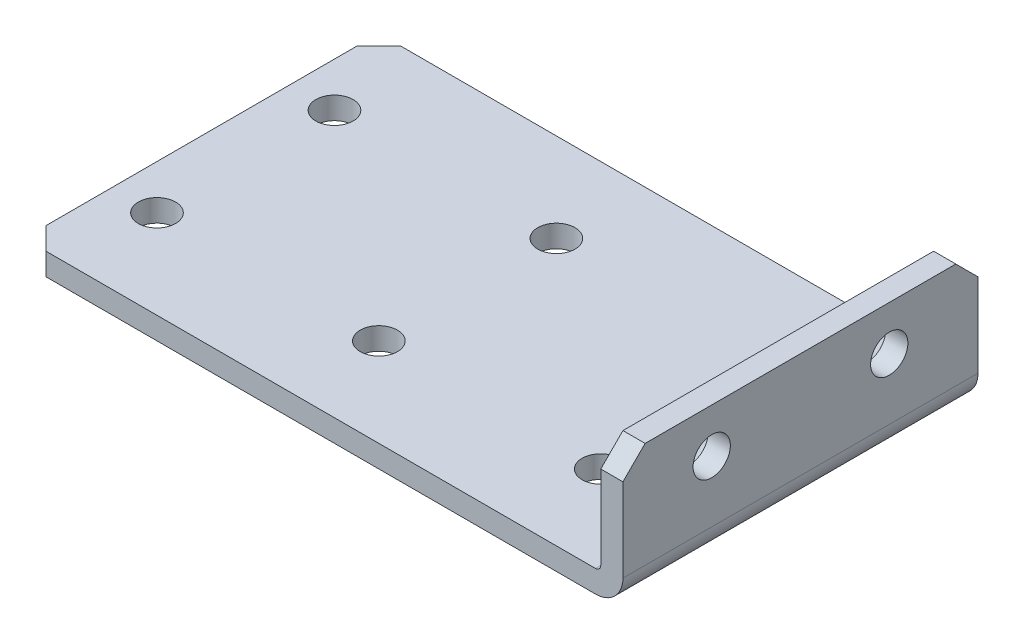
ISO-10303-21;
HEADER;
FILE_DESCRIPTION(('STEP AP214'),'2;1');
FILE_NAME('part.step','',(''),(''),'','','');
FILE_SCHEMA(('AUTOMOTIVE_DESIGN { 1 0 10303 214 1 1 1 1 }'));
ENDSEC;
DATA;
#1=APPLICATION_CONTEXT('core data for automotive mechanical design processes');
#2=APPLICATION_PROTOCOL_DEFINITION('international standard','automotive_design',2000,#1);
#3=PRODUCT_CONTEXT('',#1,'mechanical');
#4=PRODUCT('Part','Part','',(#3));
#5=PRODUCT_RELATED_PRODUCT_CATEGORY('part','',(#4));
#6=PRODUCT_DEFINITION_FORMATION('','',#4);
#7=PRODUCT_DEFINITION_CONTEXT('part definition',#1,'design');
#8=PRODUCT_DEFINITION('design','',#6,#7);
#9=PRODUCT_DEFINITION_SHAPE('','',#8);
#10=(LENGTH_UNIT() NAMED_UNIT(*) SI_UNIT(.MILLI.,.METRE.));
#11=(NAMED_UNIT(*) PLANE_ANGLE_UNIT() SI_UNIT($,.RADIAN.));
#12=(NAMED_UNIT(*) SI_UNIT($,.STERADIAN.) SOLID_ANGLE_UNIT());
#13=UNCERTAINTY_MEASURE_WITH_UNIT(LENGTH_MEASURE(1.E-05),#10,'distance_accuracy_value','');
#14=(GEOMETRIC_REPRESENTATION_CONTEXT(3) GLOBAL_UNCERTAINTY_ASSIGNED_CONTEXT((#13)) GLOBAL_UNIT_ASSIGNED_CONTEXT((#10,
#11,#12)) REPRESENTATION_CONTEXT('',''));
#15=CARTESIAN_POINT('',(0.,0.,0.));
#16=DIRECTION('',(0.,0.,1.));
#17=DIRECTION('',(1.,0.,0.));
#18=AXIS2_PLACEMENT_3D('',#15,#16,#17);
#19=CARTESIAN_POINT('',(0.,3.175,-63.5));
#20=DIRECTION('',(0.,0.,1.));
#21=DIRECTION('',(-1.,0.,0.));
#22=AXIS2_PLACEMENT_3D('',#19,#20,#21);
#23=PLANE('',#22);
#24=DIRECTION('',(1.,0.,0.));
#25=VECTOR('',#24,1.);
#26=CARTESIAN_POINT('',(0.,0.,-63.5));
#27=LINE('',#26,#25);
#28=CARTESIAN_POINT('',(81.788,0.,-63.5));
#29=VERTEX_POINT('',#28);
#30=CARTESIAN_POINT('',(3.17500000000001,0.,-63.5));
#31=VERTEX_POINT('',#30);
#32=EDGE_CURVE('E172',#29,#31,#27,.F.);
#33=ORIENTED_EDGE('',*,*,#32,.T.);
#34=DIRECTION('',(0.,-1.,0.));
#35=VECTOR('',#34,1.);
#36=CARTESIAN_POINT('',(3.17500000000001,3.175,-63.5));
#37=LINE('',#36,#35);
#38=CARTESIAN_POINT('',(3.17500000000001,3.175,-63.5));
#39=VERTEX_POINT('',#38);
#40=EDGE_CURVE('E201',#31,#39,#37,.F.);
#41=ORIENTED_EDGE('',*,*,#40,.T.);
#42=DIRECTION('',(-1.,0.,0.));
#43=VECTOR('',#42,1.);
#44=CARTESIAN_POINT('',(0.,3.175,-63.5));
#45=LINE('',#44,#43);
#46=CARTESIAN_POINT('',(81.788,3.175,-63.5));
#47=VERTEX_POINT('',#46);
#48=EDGE_CURVE('E185',#47,#39,#45,.T.);
#49=ORIENTED_EDGE('',*,*,#48,.F.);
#50=DIRECTION('',(0.,1.,0.));
#51=VECTOR('',#50,1.);
#52=CARTESIAN_POINT('',(81.788,3.175,-63.5));
#53=LINE('',#52,#51);
#54=EDGE_CURVE('E181',#29,#47,#53,.T.);
#55=ORIENTED_EDGE('',*,*,#54,.F.);
#56=EDGE_LOOP('',(#33,#41,#49,#55));
#57=FACE_BOUND('',#56,.T.);
#58=ADVANCED_FACE('F62',(#57),#23,.F.);
#59=CARTESIAN_POINT('',(0.,3.175,0.));
#60=DIRECTION('',(1.,0.,0.));
#61=DIRECTION('',(0.,0.,1.));
#62=AXIS2_PLACEMENT_3D('',#59,#60,#61);
#63=PLANE('',#62);
#64=DIRECTION('',(0.,0.,1.));
#65=VECTOR('',#64,1.);
#66=CARTESIAN_POINT('',(0.,3.175,0.));
#67=LINE('',#66,#65);
#68=CARTESIAN_POINT('',(0.,3.175,-60.325));
#69=VERTEX_POINT('',#68);
#70=CARTESIAN_POINT('',(0.,3.175,-15.875));
#71=VERTEX_POINT('',#70);
#72=EDGE_CURVE('E176',#69,#71,#67,.T.);
#73=ORIENTED_EDGE('',*,*,#72,.F.);
#74=DIRECTION('',(0.,1.,0.));
#75=VECTOR('',#74,1.);
#76=CARTESIAN_POINT('',(0.,3.175,-60.325));
#77=LINE('',#76,#75);
#78=CARTESIAN_POINT('',(0.,0.,-60.325));
#79=VERTEX_POINT('',#78);
#80=EDGE_CURVE('E210',#69,#79,#77,.F.);
#81=ORIENTED_EDGE('',*,*,#80,.T.);
#82=DIRECTION('',(0.,0.,-1.));
#83=VECTOR('',#82,1.);
#84=CARTESIAN_POINT('',(0.,0.,-63.5));
#85=LINE('',#84,#83);
#86=CARTESIAN_POINT('',(0.,0.,-15.875));
#87=VERTEX_POINT('',#86);
#88=EDGE_CURVE('E174',#79,#87,#85,.F.);
#89=ORIENTED_EDGE('',*,*,#88,.T.);
#90=DIRECTION('',(0.,-1.,0.));
#91=VECTOR('',#90,1.);
#92=CARTESIAN_POINT('',(0.,3.175,-15.875));
#93=LINE('',#92,#91);
#94=EDGE_CURVE('E208',#87,#71,#93,.F.);
#95=ORIENTED_EDGE('',*,*,#94,.T.);
#96=EDGE_LOOP('',(#73,#81,#89,#95));
#97=FACE_BOUND('',#96,.T.);
#98=ADVANCED_FACE('F229',(#97),#63,.F.);
#99=CARTESIAN_POINT('',(0.,3.175,-63.5));
#100=DIRECTION('',(0.,-1.,0.));
#101=DIRECTION('',(0.,0.,-1.));
#102=AXIS2_PLACEMENT_3D('',#99,#100,#101);
#103=PLANE('',#102);
#104=CARTESIAN_POINT('',(38.1,3.175,-25.4));
#105=DIRECTION('',(0.,1.,0.));
#106=DIRECTION('',(0.,0.,1.));
#107=AXIS2_PLACEMENT_3D('',#104,#105,#106);
#108=CIRCLE('',#107,2.667);
#109=CARTESIAN_POINT('',(38.1,3.175,-22.733));
#110=VERTEX_POINT('',#109);
#111=EDGE_CURVE('E288',#110,#110,#108,.T.);
#112=ORIENTED_EDGE('',*,*,#111,.F.);
#113=EDGE_LOOP('',(#112));
#114=FACE_BOUND('',#113,.T.);
#115=CARTESIAN_POINT('',(38.1,3.175,-50.8));
#116=DIRECTION('',(0.,1.,0.));
#117=DIRECTION('',(0.,0.,1.));
#118=AXIS2_PLACEMENT_3D('',#115,#116,#117);
#119=CIRCLE('',#118,2.667);
#120=CARTESIAN_POINT('',(38.1,3.175,-48.133));
#121=VERTEX_POINT('',#120);
#122=EDGE_CURVE('E282',#121,#121,#119,.T.);
#123=ORIENTED_EDGE('',*,*,#122,.F.);
#124=EDGE_LOOP('',(#123));
#125=FACE_BOUND('',#124,.T.);
#126=CARTESIAN_POINT('',(69.85,3.175,-25.4));
#127=DIRECTION('',(0.,1.,0.));
#128=DIRECTION('',(0.,0.,1.));
#129=AXIS2_PLACEMENT_3D('',#126,#127,#128);
#130=CIRCLE('',#129,2.667);
#131=CARTESIAN_POINT('',(69.85,3.175,-22.733));
#132=VERTEX_POINT('',#131);
#133=EDGE_CURVE('E276',#132,#132,#130,.T.);
#134=ORIENTED_EDGE('',*,*,#133,.F.);
#135=EDGE_LOOP('',(#134));
#136=FACE_BOUND('',#135,.T.);
#137=CARTESIAN_POINT('',(69.85,3.175,-50.8));
#138=DIRECTION('',(0.,1.,0.));
#139=DIRECTION('',(0.,0.,1.));
#140=AXIS2_PLACEMENT_3D('',#137,#138,#139);
#141=CIRCLE('',#140,2.667);
#142=CARTESIAN_POINT('',(69.85,3.175,-48.133));
#143=VERTEX_POINT('',#142);
#144=EDGE_CURVE('E270',#143,#143,#141,.T.);
#145=ORIENTED_EDGE('',*,*,#144,.F.);
#146=EDGE_LOOP('',(#145));
#147=FACE_BOUND('',#146,.T.);
#148=CARTESIAN_POINT('',(6.35,3.175,-25.4));
#149=DIRECTION('',(0.,1.,0.));
#150=DIRECTION('',(0.,0.,1.));
#151=AXIS2_PLACEMENT_3D('',#148,#149,#150);
#152=CIRCLE('',#151,2.667);
#153=CARTESIAN_POINT('',(6.35,3.175,-22.733));
#154=VERTEX_POINT('',#153);
#155=EDGE_CURVE('E264',#154,#154,#152,.T.);
#156=ORIENTED_EDGE('',*,*,#155,.F.);
#157=EDGE_LOOP('',(#156));
#158=FACE_BOUND('',#157,.T.);
#159=CARTESIAN_POINT('',(6.34999999999999,3.175,-50.8));
#160=DIRECTION('',(0.,1.,0.));
#161=DIRECTION('',(0.,0.,1.));
#162=AXIS2_PLACEMENT_3D('',#159,#160,#161);
#163=CIRCLE('',#162,2.667);
#164=CARTESIAN_POINT('',(6.34999999999999,3.175,-48.133));
#165=VERTEX_POINT('',#164);
#166=EDGE_CURVE('E258',#165,#165,#163,.T.);
#167=ORIENTED_EDGE('',*,*,#166,.F.);
#168=EDGE_LOOP('',(#167));
#169=FACE_BOUND('',#168,.T.);
#170=ORIENTED_EDGE('',*,*,#48,.T.);
#171=DIRECTION('',(0.707106781186548,0.,-0.707106781186548));
#172=VECTOR('',#171,1.);
#173=CARTESIAN_POINT('',(3.17500000000001,3.175,-63.5));
#174=LINE('',#173,#172);
#175=EDGE_CURVE('E206',#39,#69,#174,.F.);
#176=ORIENTED_EDGE('',*,*,#175,.T.);
#177=ORIENTED_EDGE('',*,*,#72,.T.);
#178=DIRECTION('',(-0.707106781186548,0.,-0.707106781186547));
#179=VECTOR('',#178,1.);
#180=CARTESIAN_POINT('',(3.17500000000001,3.175,-12.7));
#181=LINE('',#180,#179);
#182=CARTESIAN_POINT('',(3.17500000000001,3.175,-12.7));
#183=VERTEX_POINT('',#182);
#184=EDGE_CURVE('E204',#71,#183,#181,.F.);
#185=ORIENTED_EDGE('',*,*,#184,.T.);
#186=DIRECTION('',(1.,0.,0.));
#187=VECTOR('',#186,1.);
#188=CARTESIAN_POINT('',(0.,3.175,-12.7));
#189=LINE('',#188,#187);
#190=CARTESIAN_POINT('',(81.788,3.175,-12.7));
#191=VERTEX_POINT('',#190);
#192=EDGE_CURVE('E305',#183,#191,#189,.T.);
#193=ORIENTED_EDGE('',*,*,#192,.T.);
#194=DIRECTION('',(0.,0.,-1.));
#195=VECTOR('',#194,1.);
#196=CARTESIAN_POINT('',(81.788,3.175,0.));
#197=LINE('',#196,#195);
#198=EDGE_CURVE('E230',#191,#47,#197,.T.);
#199=ORIENTED_EDGE('',*,*,#198,.T.);
#200=EDGE_LOOP('',(#170,#176,#177,#185,#193,#199));
#201=FACE_BOUND('',#200,.T.);
#202=ADVANCED_FACE('F226',(#114,#125,#136,#147,#158,#169,#201),#103,.F.);
#203=CARTESIAN_POINT('',(0.,0.,-63.5));
#204=DIRECTION('',(0.,-1.,0.));
#205=DIRECTION('',(0.,0.,-1.));
#206=AXIS2_PLACEMENT_3D('',#203,#204,#205);
#207=PLANE('',#206);
#208=ORIENTED_EDGE('',*,*,#88,.F.);
#209=DIRECTION('',(-0.707106781186548,0.,0.707106781186548));
#210=VECTOR('',#209,1.);
#211=CARTESIAN_POINT('',(1.58750000000001,0.,-61.9125));
#212=LINE('',#211,#210);
#213=EDGE_CURVE('E213',#79,#31,#212,.F.);
#214=ORIENTED_EDGE('',*,*,#213,.T.);
#215=ORIENTED_EDGE('',*,*,#32,.F.);
#216=DIRECTION('',(0.,0.,-1.));
#217=VECTOR('',#216,1.);
#218=CARTESIAN_POINT('',(81.788,0.,-63.5));
#219=LINE('',#218,#217);
#220=CARTESIAN_POINT('',(81.788,0.,-12.7));
#221=VERTEX_POINT('',#220);
#222=EDGE_CURVE('E162',#221,#29,#219,.T.);
#223=ORIENTED_EDGE('',*,*,#222,.F.);
#224=DIRECTION('',(-1.,0.,0.));
#225=VECTOR('',#224,1.);
#226=CARTESIAN_POINT('',(-9.42940188980387,0.,-12.7));
#227=LINE('',#226,#225);
#228=CARTESIAN_POINT('',(3.17500000000001,0.,-12.7));
#229=VERTEX_POINT('',#228);
#230=EDGE_CURVE('E150',#221,#229,#227,.T.);
#231=ORIENTED_EDGE('',*,*,#230,.T.);
#232=DIRECTION('',(0.707106781186548,0.,0.707106781186547));
#233=VECTOR('',#232,1.);
#234=CARTESIAN_POINT('',(-23.8125,0.,-39.6875));
#235=LINE('',#234,#233);
#236=EDGE_CURVE('E77',#229,#87,#235,.F.);
#237=ORIENTED_EDGE('',*,*,#236,.T.);
#238=EDGE_LOOP('',(#208,#214,#215,#223,#231,#237));
#239=FACE_BOUND('',#238,.T.);
#240=CARTESIAN_POINT('',(38.1,0.,-25.4));
#241=DIRECTION('',(0.,1.,0.));
#242=DIRECTION('',(0.,0.,1.));
#243=AXIS2_PLACEMENT_3D('',#240,#241,#242);
#244=CIRCLE('',#243,2.667);
#245=CARTESIAN_POINT('',(38.1,0.,-22.733));
#246=VERTEX_POINT('',#245);
#247=EDGE_CURVE('E285',#246,#246,#244,.T.);
#248=ORIENTED_EDGE('',*,*,#247,.T.);
#249=EDGE_LOOP('',(#248));
#250=FACE_BOUND('',#249,.T.);
#251=CARTESIAN_POINT('',(38.1,0.,-50.8));
#252=DIRECTION('',(0.,1.,0.));
#253=DIRECTION('',(0.,0.,1.));
#254=AXIS2_PLACEMENT_3D('',#251,#252,#253);
#255=CIRCLE('',#254,2.667);
#256=CARTESIAN_POINT('',(38.1,0.,-48.133));
#257=VERTEX_POINT('',#256);
#258=EDGE_CURVE('E279',#257,#257,#255,.T.);
#259=ORIENTED_EDGE('',*,*,#258,.T.);
#260=EDGE_LOOP('',(#259));
#261=FACE_BOUND('',#260,.T.);
#262=CARTESIAN_POINT('',(69.85,0.,-25.4));
#263=DIRECTION('',(0.,1.,0.));
#264=DIRECTION('',(0.,0.,1.));
#265=AXIS2_PLACEMENT_3D('',#262,#263,#264);
#266=CIRCLE('',#265,2.667);
#267=CARTESIAN_POINT('',(69.85,0.,-22.733));
#268=VERTEX_POINT('',#267);
#269=EDGE_CURVE('E273',#268,#268,#266,.T.);
#270=ORIENTED_EDGE('',*,*,#269,.T.);
#271=EDGE_LOOP('',(#270));
#272=FACE_BOUND('',#271,.T.);
#273=CARTESIAN_POINT('',(69.85,0.,-50.8));
#274=DIRECTION('',(0.,1.,0.));
#275=DIRECTION('',(0.,0.,1.));
#276=AXIS2_PLACEMENT_3D('',#273,#274,#275);
#277=CIRCLE('',#276,2.667);
#278=CARTESIAN_POINT('',(69.85,0.,-48.133));
#279=VERTEX_POINT('',#278);
#280=EDGE_CURVE('E267',#279,#279,#277,.T.);
#281=ORIENTED_EDGE('',*,*,#280,.T.);
#282=EDGE_LOOP('',(#281));
#283=FACE_BOUND('',#282,.T.);
#284=CARTESIAN_POINT('',(6.35,0.,-25.4));
#285=DIRECTION('',(0.,1.,0.));
#286=DIRECTION('',(0.,0.,1.));
#287=AXIS2_PLACEMENT_3D('',#284,#285,#286);
#288=CIRCLE('',#287,2.667);
#289=CARTESIAN_POINT('',(6.35,0.,-22.733));
#290=VERTEX_POINT('',#289);
#291=EDGE_CURVE('E261',#290,#290,#288,.T.);
#292=ORIENTED_EDGE('',*,*,#291,.T.);
#293=EDGE_LOOP('',(#292));
#294=FACE_BOUND('',#293,.T.);
#295=CARTESIAN_POINT('',(6.34999999999999,0.,-50.8));
#296=DIRECTION('',(0.,1.,0.));
#297=DIRECTION('',(0.,0.,1.));
#298=AXIS2_PLACEMENT_3D('',#295,#296,#297);
#299=CIRCLE('',#298,2.667);
#300=CARTESIAN_POINT('',(6.34999999999999,0.,-48.133));
#301=VERTEX_POINT('',#300);
#302=EDGE_CURVE('E243',#301,#301,#299,.T.);
#303=ORIENTED_EDGE('',*,*,#302,.T.);
#304=EDGE_LOOP('',(#303));
#305=FACE_BOUND('',#304,.T.);
#306=ADVANCED_FACE('F169',(#239,#250,#261,#272,#283,#294,#305),#207,.T.);
#307=CARTESIAN_POINT('',(81.788,3.937,-63.5));
#308=DIRECTION('',(0.,0.,1.));
#309=DIRECTION('',(1.,0.,0.));
#310=AXIS2_PLACEMENT_3D('',#307,#308,#309);
#311=PLANE('',#310);
#312=CARTESIAN_POINT('',(81.788,3.937,-63.5));
#313=DIRECTION('',(0.,0.,-1.));
#314=DIRECTION('',(-1.,0.,0.));
#315=AXIS2_PLACEMENT_3D('',#312,#313,#314);
#316=CIRCLE('',#315,0.761999999999999);
#317=CARTESIAN_POINT('',(82.55,3.937,-63.5));
#318=VERTEX_POINT('',#317);
#319=EDGE_CURVE('E234',#318,#47,#316,.T.);
#320=ORIENTED_EDGE('',*,*,#319,.F.);
#321=DIRECTION('',(-1.,0.,0.));
#322=VECTOR('',#321,1.);
#323=CARTESIAN_POINT('',(82.55,3.937,-63.5));
#324=LINE('',#323,#322);
#325=CARTESIAN_POINT('',(85.725,3.93699999999999,-63.5));
#326=VERTEX_POINT('',#325);
#327=EDGE_CURVE('E242',#318,#326,#324,.F.);
#328=ORIENTED_EDGE('',*,*,#327,.T.);
#329=CARTESIAN_POINT('',(81.788,3.937,-63.5));
#330=DIRECTION('',(0.,0.,-1.));
#331=DIRECTION('',(-1.,0.,0.));
#332=AXIS2_PLACEMENT_3D('',#329,#330,#331);
#333=CIRCLE('',#332,3.937);
#334=EDGE_CURVE('E178',#326,#29,#333,.T.);
#335=ORIENTED_EDGE('',*,*,#334,.T.);
#336=ORIENTED_EDGE('',*,*,#54,.T.);
#337=EDGE_LOOP('',(#320,#328,#335,#336));
#338=FACE_BOUND('',#337,.T.);
#339=ADVANCED_FACE('F406',(#338),#311,.F.);
#340=CARTESIAN_POINT('',(81.788,3.937,-63.5));
#341=DIRECTION('',(0.,0.,-1.));
#342=DIRECTION('',(1.,0.,0.));
#343=AXIS2_PLACEMENT_3D('',#340,#341,#342);
#344=CYLINDRICAL_SURFACE('',#343,3.937);
#345=CARTESIAN_POINT('',(81.788,3.937,-12.7));
#346=DIRECTION('',(0.,0.,-1.));
#347=DIRECTION('',(-1.,0.,0.));
#348=AXIS2_PLACEMENT_3D('',#345,#346,#347);
#349=CIRCLE('',#348,3.937);
#350=CARTESIAN_POINT('',(85.725,3.93699999999999,-12.7));
#351=VERTEX_POINT('',#350);
#352=EDGE_CURVE('E154',#221,#351,#349,.F.);
#353=ORIENTED_EDGE('',*,*,#352,.F.);
#354=ORIENTED_EDGE('',*,*,#222,.T.);
#355=ORIENTED_EDGE('',*,*,#334,.F.);
#356=DIRECTION('',(0.,0.,-1.));
#357=VECTOR('',#356,1.);
#358=CARTESIAN_POINT('',(85.725,3.93699999999998,0.));
#359=LINE('',#358,#357);
#360=EDGE_CURVE('E165',#326,#351,#359,.F.);
#361=ORIENTED_EDGE('',*,*,#360,.T.);
#362=EDGE_LOOP('',(#353,#354,#355,#361));
#363=FACE_BOUND('',#362,.T.);
#364=ADVANCED_FACE('F161',(#363),#344,.T.);
#365=CARTESIAN_POINT('',(81.788,3.937,-63.5));
#366=DIRECTION('',(0.,0.,-1.));
#367=DIRECTION('',(1.,0.,0.));
#368=AXIS2_PLACEMENT_3D('',#365,#366,#367);
#369=CYLINDRICAL_SURFACE('',#368,0.761999999999999);
#370=ORIENTED_EDGE('',*,*,#198,.F.);
#371=CARTESIAN_POINT('',(81.788,3.937,-12.7));
#372=DIRECTION('',(0.,0.,-1.));
#373=DIRECTION('',(-1.,0.,0.));
#374=AXIS2_PLACEMENT_3D('',#371,#372,#373);
#375=CIRCLE('',#374,0.761999999999999);
#376=CARTESIAN_POINT('',(82.55,3.937,-12.7));
#377=VERTEX_POINT('',#376);
#378=EDGE_CURVE('E307',#191,#377,#375,.F.);
#379=ORIENTED_EDGE('',*,*,#378,.T.);
#380=DIRECTION('',(0.,0.,-1.));
#381=VECTOR('',#380,1.);
#382=CARTESIAN_POINT('',(82.55,3.937,0.));
#383=LINE('',#382,#381);
#384=EDGE_CURVE('E240',#377,#318,#383,.T.);
#385=ORIENTED_EDGE('',*,*,#384,.T.);
#386=ORIENTED_EDGE('',*,*,#319,.T.);
#387=EDGE_LOOP('',(#370,#379,#385,#386));
#388=FACE_BOUND('',#387,.T.);
#389=ADVANCED_FACE('F318',(#388),#369,.F.);
#390=CARTESIAN_POINT('',(85.7250000000001,19.05,-63.5));
#391=DIRECTION('',(0.,0.,1.));
#392=DIRECTION('',(1.,0.,0.));
#393=AXIS2_PLACEMENT_3D('',#390,#391,#392);
#394=PLANE('',#393);
#395=DIRECTION('',(0.,-1.,0.));
#396=VECTOR('',#395,1.);
#397=CARTESIAN_POINT('',(82.5500000000001,19.05,-63.5));
#398=LINE('',#397,#396);
#399=CARTESIAN_POINT('',(82.55,15.875,-63.5));
#400=VERTEX_POINT('',#399);
#401=EDGE_CURVE('E247',#318,#400,#398,.F.);
#402=ORIENTED_EDGE('',*,*,#401,.T.);
#403=DIRECTION('',(1.,0.,0.));
#404=VECTOR('',#403,1.);
#405=CARTESIAN_POINT('',(85.725,15.875,-63.5));
#406=LINE('',#405,#404);
#407=CARTESIAN_POINT('',(85.725,15.875,-63.5));
#408=VERTEX_POINT('',#407);
#409=EDGE_CURVE('E195',#400,#408,#406,.T.);
#410=ORIENTED_EDGE('',*,*,#409,.T.);
#411=DIRECTION('',(0.,1.,0.));
#412=VECTOR('',#411,1.);
#413=CARTESIAN_POINT('',(85.7250000000001,19.05,-63.5));
#414=LINE('',#413,#412);
#415=EDGE_CURVE('E253',#326,#408,#414,.T.);
#416=ORIENTED_EDGE('',*,*,#415,.F.);
#417=ORIENTED_EDGE('',*,*,#327,.F.);
#418=EDGE_LOOP('',(#402,#410,#416,#417));
#419=FACE_BOUND('',#418,.T.);
#420=ADVANCED_FACE('F327',(#419),#394,.F.);
#421=CARTESIAN_POINT('',(85.7250000000001,19.05,0.));
#422=DIRECTION('',(-1.,0.,0.));
#423=DIRECTION('',(0.,-1.,0.));
#424=AXIS2_PLACEMENT_3D('',#421,#422,#423);
#425=PLANE('',#424);
#426=CARTESIAN_POINT('',(85.7250000000001,12.7000000000001,-25.4));
#427=DIRECTION('',(-1.,0.,0.));
#428=DIRECTION('',(0.,-1.,0.));
#429=AXIS2_PLACEMENT_3D('',#426,#427,#428);
#430=CIRCLE('',#429,2.667);
#431=CARTESIAN_POINT('',(85.7250000000001,10.0330000000001,-25.4));
#432=VERTEX_POINT('',#431);
#433=EDGE_CURVE('E297',#432,#432,#430,.T.);
#434=ORIENTED_EDGE('',*,*,#433,.T.);
#435=EDGE_LOOP('',(#434));
#436=FACE_BOUND('',#435,.T.);
#437=CARTESIAN_POINT('',(85.7250000000001,12.7000000000001,-50.8));
#438=DIRECTION('',(-1.,0.,0.));
#439=DIRECTION('',(0.,-1.,0.));
#440=AXIS2_PLACEMENT_3D('',#437,#438,#439);
#441=CIRCLE('',#440,2.667);
#442=CARTESIAN_POINT('',(85.7250000000001,10.0330000000001,-50.8));
#443=VERTEX_POINT('',#442);
#444=EDGE_CURVE('E291',#443,#443,#441,.T.);
#445=ORIENTED_EDGE('',*,*,#444,.T.);
#446=EDGE_LOOP('',(#445));
#447=FACE_BOUND('',#446,.T.);
#448=ORIENTED_EDGE('',*,*,#415,.T.);
#449=DIRECTION('',(0.,-0.707106781186548,-0.707106781186548));
#450=VECTOR('',#449,1.);
#451=CARTESIAN_POINT('',(85.7250000000001,19.05,-60.325));
#452=LINE('',#451,#450);
#453=CARTESIAN_POINT('',(85.7250000000001,19.05,-60.325));
#454=VERTEX_POINT('',#453);
#455=EDGE_CURVE('E199',#408,#454,#452,.F.);
#456=ORIENTED_EDGE('',*,*,#455,.T.);
#457=DIRECTION('',(0.,0.,1.));
#458=VECTOR('',#457,1.);
#459=CARTESIAN_POINT('',(85.7250000000001,19.05,0.));
#460=LINE('',#459,#458);
#461=CARTESIAN_POINT('',(85.7250000000001,19.05,-15.875));
#462=VERTEX_POINT('',#461);
#463=EDGE_CURVE('E238',#454,#462,#460,.T.);
#464=ORIENTED_EDGE('',*,*,#463,.T.);
#465=DIRECTION('',(0.,0.707106781186549,-0.707106781186546));
#466=VECTOR('',#465,1.);
#467=CARTESIAN_POINT('',(85.7250000000001,19.05,-15.875));
#468=LINE('',#467,#466);
#469=CARTESIAN_POINT('',(85.725,15.875,-12.7));
#470=VERTEX_POINT('',#469);
#471=EDGE_CURVE('E197',#462,#470,#468,.F.);
#472=ORIENTED_EDGE('',*,*,#471,.T.);
#473=DIRECTION('',(0.,-1.,0.));
#474=VECTOR('',#473,1.);
#475=CARTESIAN_POINT('',(85.7250000000001,19.05,-12.7));
#476=LINE('',#475,#474);
#477=EDGE_CURVE('E167',#470,#351,#476,.T.);
#478=ORIENTED_EDGE('',*,*,#477,.T.);
#479=ORIENTED_EDGE('',*,*,#360,.F.);
#480=EDGE_LOOP('',(#448,#456,#464,#472,#478,#479));
#481=FACE_BOUND('',#480,.T.);
#482=ADVANCED_FACE('F335',(#436,#447,#481),#425,.F.);
#483=CARTESIAN_POINT('',(82.5500000000001,19.05,0.));
#484=DIRECTION('',(-1.,0.,0.));
#485=DIRECTION('',(0.,-1.,0.));
#486=AXIS2_PLACEMENT_3D('',#483,#484,#485);
#487=PLANE('',#486);
#488=DIRECTION('',(0.,0.,-1.));
#489=VECTOR('',#488,1.);
#490=CARTESIAN_POINT('',(82.5500000000001,19.05,0.));
#491=LINE('',#490,#489);
#492=CARTESIAN_POINT('',(82.5500000000001,19.05,-60.325));
#493=VERTEX_POINT('',#492);
#494=CARTESIAN_POINT('',(82.5500000000001,19.05,-15.875));
#495=VERTEX_POINT('',#494);
#496=EDGE_CURVE('E250',#493,#495,#491,.F.);
#497=ORIENTED_EDGE('',*,*,#496,.F.);
#498=DIRECTION('',(0.,0.707106781186548,0.707106781186548));
#499=VECTOR('',#498,1.);
#500=CARTESIAN_POINT('',(82.5500000000002,49.2125,-30.1625));
#501=LINE('',#500,#499);
#502=EDGE_CURVE('E193',#493,#400,#501,.F.);
#503=ORIENTED_EDGE('',*,*,#502,.T.);
#504=ORIENTED_EDGE('',*,*,#401,.F.);
#505=ORIENTED_EDGE('',*,*,#384,.F.);
#506=DIRECTION('',(0.,-1.,0.));
#507=VECTOR('',#506,1.);
#508=CARTESIAN_POINT('',(82.5500000000001,19.05,-12.7));
#509=LINE('',#508,#507);
#510=CARTESIAN_POINT('',(82.55,15.875,-12.7));
#511=VERTEX_POINT('',#510);
#512=EDGE_CURVE('E158',#511,#377,#509,.T.);
#513=ORIENTED_EDGE('',*,*,#512,.F.);
#514=DIRECTION('',(0.,-0.707106781186549,0.707106781186546));
#515=VECTOR('',#514,1.);
#516=CARTESIAN_POINT('',(82.55,11.1125,-7.93750000000004));
#517=LINE('',#516,#515);
#518=EDGE_CURVE('E191',#511,#495,#517,.F.);
#519=ORIENTED_EDGE('',*,*,#518,.T.);
#520=EDGE_LOOP('',(#497,#503,#504,#505,#513,#519));
#521=FACE_BOUND('',#520,.T.);
#522=CARTESIAN_POINT('',(82.55,12.7000000000001,-25.4));
#523=DIRECTION('',(-1.,0.,0.));
#524=DIRECTION('',(0.,-1.,0.));
#525=AXIS2_PLACEMENT_3D('',#522,#523,#524);
#526=CIRCLE('',#525,2.667);
#527=CARTESIAN_POINT('',(82.55,10.0330000000001,-25.4));
#528=VERTEX_POINT('',#527);
#529=EDGE_CURVE('E166',#528,#528,#526,.T.);
#530=ORIENTED_EDGE('',*,*,#529,.F.);
#531=EDGE_LOOP('',(#530));
#532=FACE_BOUND('',#531,.T.);
#533=CARTESIAN_POINT('',(82.55,12.7000000000001,-50.8));
#534=DIRECTION('',(-1.,0.,0.));
#535=DIRECTION('',(0.,-1.,0.));
#536=AXIS2_PLACEMENT_3D('',#533,#534,#535);
#537=CIRCLE('',#536,2.667);
#538=CARTESIAN_POINT('',(82.55,10.0330000000001,-50.8));
#539=VERTEX_POINT('',#538);
#540=EDGE_CURVE('E294',#539,#539,#537,.T.);
#541=ORIENTED_EDGE('',*,*,#540,.F.);
#542=EDGE_LOOP('',(#541));
#543=FACE_BOUND('',#542,.T.);
#544=ADVANCED_FACE('F322',(#521,#532,#543),#487,.T.);
#545=CARTESIAN_POINT('',(85.7250000000001,19.05,0.));
#546=DIRECTION('',(0.,-1.,0.));
#547=DIRECTION('',(1.,0.,0.));
#548=AXIS2_PLACEMENT_3D('',#545,#546,#547);
#549=PLANE('',#548);
#550=ORIENTED_EDGE('',*,*,#463,.F.);
#551=DIRECTION('',(-1.,0.,0.));
#552=VECTOR('',#551,1.);
#553=CARTESIAN_POINT('',(85.7250000000001,19.05,-60.325));
#554=LINE('',#553,#552);
#555=EDGE_CURVE('E188',#454,#493,#554,.T.);
#556=ORIENTED_EDGE('',*,*,#555,.T.);
#557=ORIENTED_EDGE('',*,*,#496,.T.);
#558=DIRECTION('',(1.,0.,0.));
#559=VECTOR('',#558,1.);
#560=CARTESIAN_POINT('',(85.7250000000001,19.05,-15.875));
#561=LINE('',#560,#559);
#562=EDGE_CURVE('E184',#495,#462,#561,.T.);
#563=ORIENTED_EDGE('',*,*,#562,.T.);
#564=EDGE_LOOP('',(#550,#556,#557,#563));
#565=FACE_BOUND('',#564,.T.);
#566=ADVANCED_FACE('F337',(#565),#549,.F.);
#567=CARTESIAN_POINT('',(6.34999999999999,0.,-50.8));
#568=DIRECTION('',(0.,1.,0.));
#569=DIRECTION('',(0.,0.,1.));
#570=AXIS2_PLACEMENT_3D('',#567,#568,#569);
#571=CYLINDRICAL_SURFACE('',#570,2.667);
#572=ORIENTED_EDGE('',*,*,#302,.F.);
#573=EDGE_LOOP('',(#572));
#574=FACE_BOUND('',#573,.T.);
#575=ORIENTED_EDGE('',*,*,#166,.T.);
#576=EDGE_LOOP('',(#575));
#577=FACE_BOUND('',#576,.T.);
#578=ADVANCED_FACE('F390',(#574,#577),#571,.F.);
#579=CARTESIAN_POINT('',(6.35,0.,-25.4));
#580=DIRECTION('',(0.,1.,0.));
#581=DIRECTION('',(0.,0.,1.));
#582=AXIS2_PLACEMENT_3D('',#579,#580,#581);
#583=CYLINDRICAL_SURFACE('',#582,2.667);
#584=ORIENTED_EDGE('',*,*,#291,.F.);
#585=EDGE_LOOP('',(#584));
#586=FACE_BOUND('',#585,.T.);
#587=ORIENTED_EDGE('',*,*,#155,.T.);
#588=EDGE_LOOP('',(#587));
#589=FACE_BOUND('',#588,.T.);
#590=ADVANCED_FACE('F386',(#586,#589),#583,.F.);
#591=CARTESIAN_POINT('',(69.85,0.,-50.8));
#592=DIRECTION('',(0.,1.,0.));
#593=DIRECTION('',(0.,0.,1.));
#594=AXIS2_PLACEMENT_3D('',#591,#592,#593);
#595=CYLINDRICAL_SURFACE('',#594,2.667);
#596=ORIENTED_EDGE('',*,*,#280,.F.);
#597=EDGE_LOOP('',(#596));
#598=FACE_BOUND('',#597,.T.);
#599=ORIENTED_EDGE('',*,*,#144,.T.);
#600=EDGE_LOOP('',(#599));
#601=FACE_BOUND('',#600,.T.);
#602=ADVANCED_FACE('F382',(#598,#601),#595,.F.);
#603=CARTESIAN_POINT('',(69.85,0.,-25.4));
#604=DIRECTION('',(0.,1.,0.));
#605=DIRECTION('',(0.,0.,1.));
#606=AXIS2_PLACEMENT_3D('',#603,#604,#605);
#607=CYLINDRICAL_SURFACE('',#606,2.667);
#608=ORIENTED_EDGE('',*,*,#269,.F.);
#609=EDGE_LOOP('',(#608));
#610=FACE_BOUND('',#609,.T.);
#611=ORIENTED_EDGE('',*,*,#133,.T.);
#612=EDGE_LOOP('',(#611));
#613=FACE_BOUND('',#612,.T.);
#614=ADVANCED_FACE('F378',(#610,#613),#607,.F.);
#615=CARTESIAN_POINT('',(38.1,0.,-50.8));
#616=DIRECTION('',(0.,1.,0.));
#617=DIRECTION('',(0.,0.,1.));
#618=AXIS2_PLACEMENT_3D('',#615,#616,#617);
#619=CYLINDRICAL_SURFACE('',#618,2.667);
#620=ORIENTED_EDGE('',*,*,#258,.F.);
#621=EDGE_LOOP('',(#620));
#622=FACE_BOUND('',#621,.T.);
#623=ORIENTED_EDGE('',*,*,#122,.T.);
#624=EDGE_LOOP('',(#623));
#625=FACE_BOUND('',#624,.T.);
#626=ADVANCED_FACE('F374',(#622,#625),#619,.F.);
#627=CARTESIAN_POINT('',(38.1,0.,-25.4));
#628=DIRECTION('',(0.,1.,0.));
#629=DIRECTION('',(0.,0.,1.));
#630=AXIS2_PLACEMENT_3D('',#627,#628,#629);
#631=CYLINDRICAL_SURFACE('',#630,2.667);
#632=ORIENTED_EDGE('',*,*,#247,.F.);
#633=EDGE_LOOP('',(#632));
#634=FACE_BOUND('',#633,.T.);
#635=ORIENTED_EDGE('',*,*,#111,.T.);
#636=EDGE_LOOP('',(#635));
#637=FACE_BOUND('',#636,.T.);
#638=ADVANCED_FACE('F370',(#634,#637),#631,.F.);
#639=CARTESIAN_POINT('',(85.7250000000001,12.7000000000001,-50.8));
#640=DIRECTION('',(-1.,0.,0.));
#641=DIRECTION('',(0.,-1.,0.));
#642=AXIS2_PLACEMENT_3D('',#639,#640,#641);
#643=CYLINDRICAL_SURFACE('',#642,2.667);
#644=ORIENTED_EDGE('',*,*,#444,.F.);
#645=EDGE_LOOP('',(#644));
#646=FACE_BOUND('',#645,.T.);
#647=ORIENTED_EDGE('',*,*,#540,.T.);
#648=EDGE_LOOP('',(#647));
#649=FACE_BOUND('',#648,.T.);
#650=ADVANCED_FACE('F364',(#646,#649),#643,.F.);
#651=CARTESIAN_POINT('',(85.7250000000001,12.7000000000001,-25.4));
#652=DIRECTION('',(-1.,0.,0.));
#653=DIRECTION('',(0.,-1.,0.));
#654=AXIS2_PLACEMENT_3D('',#651,#652,#653);
#655=CYLINDRICAL_SURFACE('',#654,2.667);
#656=ORIENTED_EDGE('',*,*,#433,.F.);
#657=EDGE_LOOP('',(#656));
#658=FACE_BOUND('',#657,.T.);
#659=ORIENTED_EDGE('',*,*,#529,.T.);
#660=EDGE_LOOP('',(#659));
#661=FACE_BOUND('',#660,.T.);
#662=ADVANCED_FACE('F359',(#658,#661),#655,.F.);
#663=CARTESIAN_POINT('',(-9.42940188980387,0.,-12.7));
#664=DIRECTION('',(0.,0.,-1.));
#665=DIRECTION('',(-1.,0.,0.));
#666=AXIS2_PLACEMENT_3D('',#663,#664,#665);
#667=PLANE('',#666);
#668=ORIENTED_EDGE('',*,*,#477,.F.);
#669=DIRECTION('',(-1.,0.,0.));
#670=VECTOR('',#669,1.);
#671=CARTESIAN_POINT('',(-9.42940188980381,15.8750000000003,-12.7));
#672=LINE('',#671,#670);
#673=EDGE_CURVE('E13',#470,#511,#672,.T.);
#674=ORIENTED_EDGE('',*,*,#673,.T.);
#675=ORIENTED_EDGE('',*,*,#512,.T.);
#676=ORIENTED_EDGE('',*,*,#378,.F.);
#677=ORIENTED_EDGE('',*,*,#192,.F.);
#678=DIRECTION('',(0.,-1.,0.));
#679=VECTOR('',#678,1.);
#680=CARTESIAN_POINT('',(3.17500000000001,0.,-12.7));
#681=LINE('',#680,#679);
#682=EDGE_CURVE('E70',#183,#229,#681,.T.);
#683=ORIENTED_EDGE('',*,*,#682,.T.);
#684=ORIENTED_EDGE('',*,*,#230,.F.);
#685=ORIENTED_EDGE('',*,*,#352,.T.);
#686=EDGE_LOOP('',(#668,#674,#675,#676,#677,#683,#684,#685));
#687=FACE_BOUND('',#686,.T.);
#688=ADVANCED_FACE('F153',(#687),#667,.F.);
#689=CARTESIAN_POINT('',(85.7250000000001,19.05,-60.325));
#690=DIRECTION('',(0.,-0.707106781186548,0.707106781186548));
#691=DIRECTION('',(0.,-0.707106781186548,-0.707106781186548));
#692=AXIS2_PLACEMENT_3D('',#689,#690,#691);
#693=PLANE('',#692);
#694=ORIENTED_EDGE('',*,*,#455,.F.);
#695=ORIENTED_EDGE('',*,*,#409,.F.);
#696=ORIENTED_EDGE('',*,*,#502,.F.);
#697=ORIENTED_EDGE('',*,*,#555,.F.);
#698=EDGE_LOOP('',(#694,#695,#696,#697));
#699=FACE_BOUND('',#698,.T.);
#700=ADVANCED_FACE('F331',(#699),#693,.F.);
#701=CARTESIAN_POINT('',(3.17500000000001,3.175,-63.5));
#702=DIRECTION('',(0.707106781186548,0.,0.707106781186548));
#703=DIRECTION('',(0.707106781186548,0.,-0.707106781186548));
#704=AXIS2_PLACEMENT_3D('',#701,#702,#703);
#705=PLANE('',#704);
#706=ORIENTED_EDGE('',*,*,#213,.F.);
#707=ORIENTED_EDGE('',*,*,#80,.F.);
#708=ORIENTED_EDGE('',*,*,#175,.F.);
#709=ORIENTED_EDGE('',*,*,#40,.F.);
#710=EDGE_LOOP('',(#706,#707,#708,#709));
#711=FACE_BOUND('',#710,.T.);
#712=ADVANCED_FACE('F222',(#711),#705,.F.);
#713=CARTESIAN_POINT('',(85.7250000000001,19.05,-15.875));
#714=DIRECTION('',(0.,-0.707106781186546,-0.707106781186549));
#715=DIRECTION('',(0.,0.707106781186549,-0.707106781186546));
#716=AXIS2_PLACEMENT_3D('',#713,#714,#715);
#717=PLANE('',#716);
#718=ORIENTED_EDGE('',*,*,#518,.F.);
#719=ORIENTED_EDGE('',*,*,#673,.F.);
#720=ORIENTED_EDGE('',*,*,#471,.F.);
#721=ORIENTED_EDGE('',*,*,#562,.F.);
#722=EDGE_LOOP('',(#718,#719,#720,#721));
#723=FACE_BOUND('',#722,.T.);
#724=ADVANCED_FACE('F340',(#723),#717,.F.);
#725=CARTESIAN_POINT('',(3.17500000000001,0.,-12.7));
#726=DIRECTION('',(0.707106781186547,0.,-0.707106781186548));
#727=DIRECTION('',(-0.707106781186548,0.,-0.707106781186547));
#728=AXIS2_PLACEMENT_3D('',#725,#726,#727);
#729=PLANE('',#728);
#730=ORIENTED_EDGE('',*,*,#184,.F.);
#731=ORIENTED_EDGE('',*,*,#94,.F.);
#732=ORIENTED_EDGE('',*,*,#236,.F.);
#733=ORIENTED_EDGE('',*,*,#682,.F.);
#734=EDGE_LOOP('',(#730,#731,#732,#733));
#735=FACE_BOUND('',#734,.T.);
#736=ADVANCED_FACE('F64',(#735),#729,.F.);
#737=CLOSED_SHELL('',(#58,#98,#202,#306,#339,#364,#389,#420,#482,#544,#566,#578,#590,#602,#614,
#626,#638,#650,#662,#688,#700,#712,#724,#736));
#738=MANIFOLD_SOLID_BREP('B2',#737);
#739=ADVANCED_BREP_SHAPE_REPRESENTATION('',(#18,#738),#14);
#740=SHAPE_DEFINITION_REPRESENTATION(#9,#739);
ENDSEC;
END-ISO-10303-21;
